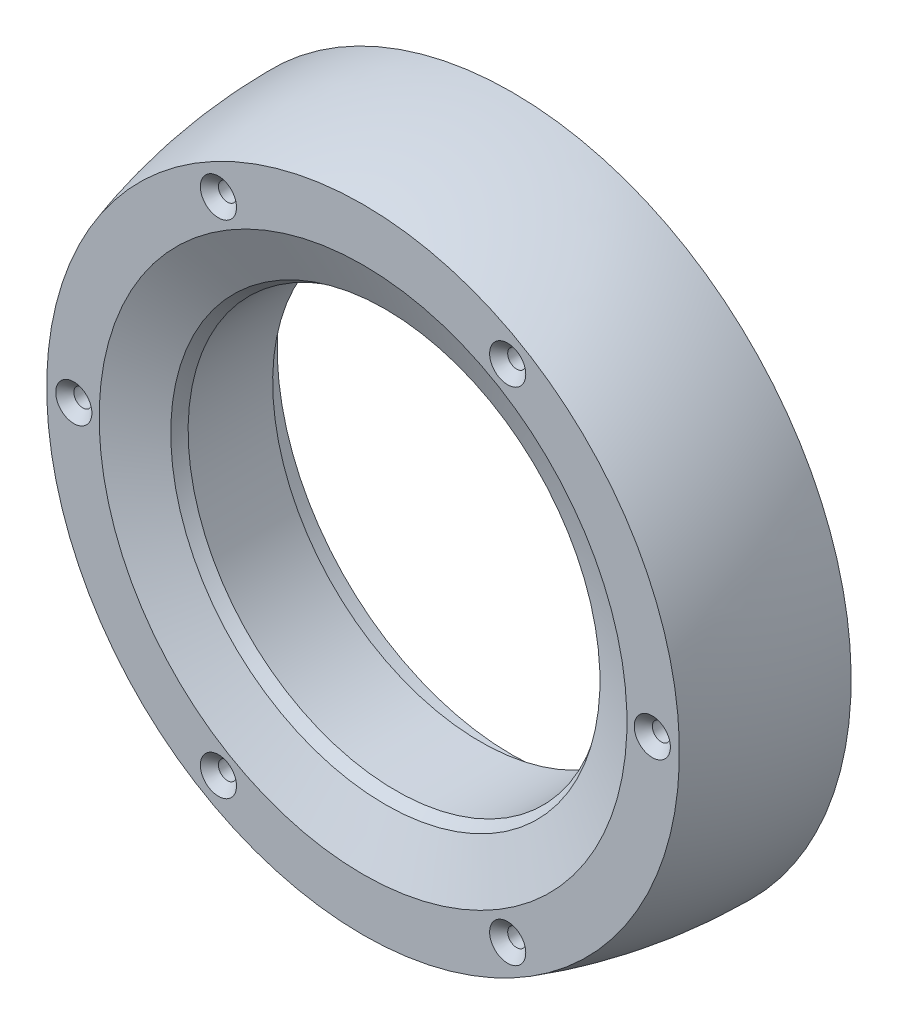
ISO-10303-21;
HEADER;
FILE_DESCRIPTION(('STEP AP214'),'2;1');
FILE_NAME('part.step','',(''),(''),'','','');
FILE_SCHEMA(('AUTOMOTIVE_DESIGN { 1 0 10303 214 1 1 1 1 }'));
ENDSEC;
DATA;
#1=APPLICATION_CONTEXT('core data for automotive mechanical design processes');
#2=APPLICATION_PROTOCOL_DEFINITION('international standard','automotive_design',2000,#1);
#3=PRODUCT_CONTEXT('',#1,'mechanical');
#4=PRODUCT('Part','Part','',(#3));
#5=PRODUCT_RELATED_PRODUCT_CATEGORY('part','',(#4));
#6=PRODUCT_DEFINITION_FORMATION('','',#4);
#7=PRODUCT_DEFINITION_CONTEXT('part definition',#1,'design');
#8=PRODUCT_DEFINITION('design','',#6,#7);
#9=PRODUCT_DEFINITION_SHAPE('','',#8);
#10=(LENGTH_UNIT() NAMED_UNIT(*) SI_UNIT(.MILLI.,.METRE.));
#11=(NAMED_UNIT(*) PLANE_ANGLE_UNIT() SI_UNIT($,.RADIAN.));
#12=(NAMED_UNIT(*) SI_UNIT($,.STERADIAN.) SOLID_ANGLE_UNIT());
#13=UNCERTAINTY_MEASURE_WITH_UNIT(LENGTH_MEASURE(1.E-05),#10,'distance_accuracy_value','');
#14=(GEOMETRIC_REPRESENTATION_CONTEXT(3) GLOBAL_UNCERTAINTY_ASSIGNED_CONTEXT((#13)) GLOBAL_UNIT_ASSIGNED_CONTEXT((#10,
#11,#12)) REPRESENTATION_CONTEXT('',''));
#15=CARTESIAN_POINT('',(0.,0.,0.));
#16=DIRECTION('',(0.,0.,1.));
#17=DIRECTION('',(1.,0.,0.));
#18=AXIS2_PLACEMENT_3D('',#15,#16,#17);
#19=CARTESIAN_POINT('',(0.,0.,16.5));
#20=DIRECTION('',(0.,0.,1.));
#21=DIRECTION('',(0.,-1.,0.));
#22=AXIS2_PLACEMENT_3D('',#19,#20,#21);
#23=PLANE('',#22);
#24=CARTESIAN_POINT('',(-16.,27.712812921102,16.5));
#25=DIRECTION('',(0.,0.,1.));
#26=DIRECTION('',(1.,0.,0.));
#27=AXIS2_PLACEMENT_3D('',#24,#25,#26);
#28=CIRCLE('',#27,2.);
#29=CARTESIAN_POINT('',(-14.,27.712812921102,16.5));
#30=VERTEX_POINT('',#29);
#31=EDGE_CURVE('E117',#30,#30,#28,.T.);
#32=ORIENTED_EDGE('',*,*,#31,.F.);
#33=EDGE_LOOP('',(#32));
#34=FACE_BOUND('',#33,.T.);
#35=CARTESIAN_POINT('',(16.,27.7128129211021,16.5));
#36=DIRECTION('',(0.,0.,1.));
#37=DIRECTION('',(1.,0.,0.));
#38=AXIS2_PLACEMENT_3D('',#35,#36,#37);
#39=CIRCLE('',#38,2.);
#40=CARTESIAN_POINT('',(18.,27.7128129211021,16.5));
#41=VERTEX_POINT('',#40);
#42=EDGE_CURVE('E108',#41,#41,#39,.T.);
#43=ORIENTED_EDGE('',*,*,#42,.F.);
#44=EDGE_LOOP('',(#43));
#45=FACE_BOUND('',#44,.T.);
#46=CARTESIAN_POINT('',(32.,0.,16.5));
#47=DIRECTION('',(0.,0.,1.));
#48=DIRECTION('',(1.,0.,0.));
#49=AXIS2_PLACEMENT_3D('',#46,#47,#48);
#50=CIRCLE('',#49,2.);
#51=CARTESIAN_POINT('',(34.,0.,16.5));
#52=VERTEX_POINT('',#51);
#53=EDGE_CURVE('E99',#52,#52,#50,.T.);
#54=ORIENTED_EDGE('',*,*,#53,.F.);
#55=EDGE_LOOP('',(#54));
#56=FACE_BOUND('',#55,.T.);
#57=CARTESIAN_POINT('',(16.,-27.7128129211021,16.5));
#58=DIRECTION('',(0.,0.,1.));
#59=DIRECTION('',(1.,0.,0.));
#60=AXIS2_PLACEMENT_3D('',#57,#58,#59);
#61=CIRCLE('',#60,2.);
#62=CARTESIAN_POINT('',(18.,-27.7128129211021,16.5));
#63=VERTEX_POINT('',#62);
#64=EDGE_CURVE('E90',#63,#63,#61,.T.);
#65=ORIENTED_EDGE('',*,*,#64,.F.);
#66=EDGE_LOOP('',(#65));
#67=FACE_BOUND('',#66,.T.);
#68=CARTESIAN_POINT('',(-16.,-27.7128129211021,16.5));
#69=DIRECTION('',(0.,0.,1.));
#70=DIRECTION('',(1.,0.,0.));
#71=AXIS2_PLACEMENT_3D('',#68,#69,#70);
#72=CIRCLE('',#71,2.);
#73=CARTESIAN_POINT('',(-14.,-27.7128129211021,16.5));
#74=VERTEX_POINT('',#73);
#75=EDGE_CURVE('E81',#74,#74,#72,.T.);
#76=ORIENTED_EDGE('',*,*,#75,.F.);
#77=EDGE_LOOP('',(#76));
#78=FACE_BOUND('',#77,.T.);
#79=CARTESIAN_POINT('',(-32.,0.,16.5));
#80=DIRECTION('',(0.,0.,1.));
#81=DIRECTION('',(1.,0.,0.));
#82=AXIS2_PLACEMENT_3D('',#79,#80,#81);
#83=CIRCLE('',#82,2.);
#84=CARTESIAN_POINT('',(-30.,0.,16.5));
#85=VERTEX_POINT('',#84);
#86=EDGE_CURVE('E72',#85,#85,#83,.T.);
#87=ORIENTED_EDGE('',*,*,#86,.F.);
#88=EDGE_LOOP('',(#87));
#89=FACE_BOUND('',#88,.T.);
#90=CARTESIAN_POINT('',(0.,0.,16.5));
#91=DIRECTION('',(0.,0.,1.));
#92=DIRECTION('',(0.,-1.,0.));
#93=AXIS2_PLACEMENT_3D('',#90,#91,#92);
#94=CIRCLE('',#93,29.196314195817);
#95=CARTESIAN_POINT('',(0.,-29.196314195817,16.5));
#96=VERTEX_POINT('',#95);
#97=EDGE_CURVE('E41',#96,#96,#94,.F.);
#98=ORIENTED_EDGE('',*,*,#97,.T.);
#99=EDGE_LOOP('',(#98));
#100=FACE_BOUND('',#99,.T.);
#101=CARTESIAN_POINT('',(0.,0.,16.5));
#102=DIRECTION('',(0.,0.,-1.));
#103=DIRECTION('',(0.,1.,0.));
#104=AXIS2_PLACEMENT_3D('',#101,#102,#103);
#105=CIRCLE('',#104,35.);
#106=CARTESIAN_POINT('',(0.,35.,16.5));
#107=VERTEX_POINT('',#106);
#108=EDGE_CURVE('E63',#107,#107,#105,.T.);
#109=ORIENTED_EDGE('',*,*,#108,.F.);
#110=EDGE_LOOP('',(#109));
#111=FACE_BOUND('',#110,.T.);
#112=ADVANCED_FACE('F34',(#34,#45,#56,#67,#78,#89,#100,#111),#23,.T.);
#113=CARTESIAN_POINT('',(0.,0.,22.5));
#114=DIRECTION('',(0.,0.,-1.));
#115=DIRECTION('',(0.,1.,0.));
#116=AXIS2_PLACEMENT_3D('',#113,#114,#115);
#117=DEGENERATE_TOROIDAL_SURFACE('',#116,9.,17.,.T.);
#118=CARTESIAN_POINT('',(0.,0.,14.0333791781715));
#119=DIRECTION('',(0.,0.,1.));
#120=DIRECTION('',(0.,-1.,0.));
#121=AXIS2_PLACEMENT_3D('',#118,#119,#120);
#122=CIRCLE('',#121,23.7416529554653);
#123=CARTESIAN_POINT('',(0.,-23.7416529554653,14.0333791781715));
#124=VERTEX_POINT('',#123);
#125=EDGE_CURVE('E10',#124,#124,#122,.T.);
#126=ORIENTED_EDGE('',*,*,#125,.T.);
#127=EDGE_LOOP('',(#126));
#128=FACE_BOUND('',#127,.T.);
#129=CARTESIAN_POINT('',(0.,0.,12.856349239007));
#130=DIRECTION('',(0.,0.,-1.));
#131=DIRECTION('',(0.,1.,0.));
#132=AXIS2_PLACEMENT_3D('',#129,#130,#131);
#133=CIRCLE('',#132,23.);
#134=CARTESIAN_POINT('',(0.,23.,12.856349239007));
#135=VERTEX_POINT('',#134);
#136=EDGE_CURVE('E45',#135,#135,#133,.T.);
#137=ORIENTED_EDGE('',*,*,#136,.T.);
#138=EDGE_LOOP('',(#137));
#139=FACE_BOUND('',#138,.T.);
#140=ADVANCED_FACE('F125',(#128,#139),#117,.F.);
#141=CARTESIAN_POINT('',(0.,0.,-11.0117281202219));
#142=DIRECTION('',(0.,0.,-1.));
#143=DIRECTION('',(0.,1.,0.));
#144=AXIS2_PLACEMENT_3D('',#141,#142,#143);
#145=CYLINDRICAL_SURFACE('',#144,23.);
#146=ORIENTED_EDGE('',*,*,#136,.F.);
#147=EDGE_LOOP('',(#146));
#148=FACE_BOUND('',#147,.T.);
#149=CARTESIAN_POINT('',(0.,0.,3.5));
#150=DIRECTION('',(0.,0.,-1.));
#151=DIRECTION('',(0.,1.,0.));
#152=AXIS2_PLACEMENT_3D('',#149,#150,#151);
#153=CIRCLE('',#152,23.);
#154=CARTESIAN_POINT('',(0.,23.,3.5));
#155=VERTEX_POINT('',#154);
#156=EDGE_CURVE('E49',#155,#155,#153,.T.);
#157=ORIENTED_EDGE('',*,*,#156,.T.);
#158=EDGE_LOOP('',(#157));
#159=FACE_BOUND('',#158,.T.);
#160=ADVANCED_FACE('F159',(#148,#159),#145,.F.);
#161=CARTESIAN_POINT('',(0.,0.,3.5));
#162=DIRECTION('',(0.,0.,1.));
#163=DIRECTION('',(0.,-1.,0.));
#164=AXIS2_PLACEMENT_3D('',#161,#162,#163);
#165=PLANE('',#164);
#166=ORIENTED_EDGE('',*,*,#156,.F.);
#167=EDGE_LOOP('',(#166));
#168=FACE_BOUND('',#167,.T.);
#169=CARTESIAN_POINT('',(0.,0.,3.5));
#170=DIRECTION('',(0.,0.,-1.));
#171=DIRECTION('',(0.,1.,0.));
#172=AXIS2_PLACEMENT_3D('',#169,#170,#171);
#173=CIRCLE('',#172,26.);
#174=CARTESIAN_POINT('',(0.,26.,3.5));
#175=VERTEX_POINT('',#174);
#176=EDGE_CURVE('E54',#175,#175,#173,.T.);
#177=ORIENTED_EDGE('',*,*,#176,.T.);
#178=EDGE_LOOP('',(#177));
#179=FACE_BOUND('',#178,.T.);
#180=ADVANCED_FACE('F154',(#168,#179),#165,.F.);
#181=CARTESIAN_POINT('',(0.,0.,-11.0117281202219));
#182=DIRECTION('',(0.,0.,-1.));
#183=DIRECTION('',(0.,1.,0.));
#184=AXIS2_PLACEMENT_3D('',#181,#182,#183);
#185=CYLINDRICAL_SURFACE('',#184,26.);
#186=CARTESIAN_POINT('',(0.,0.,0.));
#187=DIRECTION('',(0.,0.,-1.));
#188=DIRECTION('',(0.,1.,0.));
#189=AXIS2_PLACEMENT_3D('',#186,#187,#188);
#190=CIRCLE('',#189,26.);
#191=CARTESIAN_POINT('',(0.,26.,0.));
#192=VERTEX_POINT('',#191);
#193=EDGE_CURVE('E57',#192,#192,#190,.T.);
#194=ORIENTED_EDGE('',*,*,#193,.T.);
#195=EDGE_LOOP('',(#194));
#196=FACE_BOUND('',#195,.T.);
#197=ORIENTED_EDGE('',*,*,#176,.F.);
#198=EDGE_LOOP('',(#197));
#199=FACE_BOUND('',#198,.T.);
#200=ADVANCED_FACE('F147',(#196,#199),#185,.F.);
#201=CARTESIAN_POINT('',(0.,0.,0.));
#202=DIRECTION('',(0.,0.,-1.));
#203=DIRECTION('',(0.,1.,0.));
#204=AXIS2_PLACEMENT_3D('',#201,#202,#203);
#205=PLANE('',#204);
#206=CARTESIAN_POINT('',(-16.,27.712812921102,0.));
#207=DIRECTION('',(0.,0.,1.));
#208=DIRECTION('',(1.,0.,0.));
#209=AXIS2_PLACEMENT_3D('',#206,#207,#208);
#210=CIRCLE('',#209,0.999999999999996);
#211=CARTESIAN_POINT('',(-15.,27.712812921102,0.));
#212=VERTEX_POINT('',#211);
#213=EDGE_CURVE('E111',#212,#212,#210,.T.);
#214=ORIENTED_EDGE('',*,*,#213,.T.);
#215=EDGE_LOOP('',(#214));
#216=FACE_BOUND('',#215,.T.);
#217=CARTESIAN_POINT('',(16.,27.7128129211021,0.));
#218=DIRECTION('',(0.,0.,1.));
#219=DIRECTION('',(1.,0.,0.));
#220=AXIS2_PLACEMENT_3D('',#217,#218,#219);
#221=CIRCLE('',#220,0.999999999999997);
#222=CARTESIAN_POINT('',(17.,27.7128129211021,0.));
#223=VERTEX_POINT('',#222);
#224=EDGE_CURVE('E102',#223,#223,#221,.T.);
#225=ORIENTED_EDGE('',*,*,#224,.T.);
#226=EDGE_LOOP('',(#225));
#227=FACE_BOUND('',#226,.T.);
#228=CARTESIAN_POINT('',(32.,0.,0.));
#229=DIRECTION('',(0.,0.,1.));
#230=DIRECTION('',(1.,0.,0.));
#231=AXIS2_PLACEMENT_3D('',#228,#229,#230);
#232=CIRCLE('',#231,0.999999999999994);
#233=CARTESIAN_POINT('',(33.,0.,0.));
#234=VERTEX_POINT('',#233);
#235=EDGE_CURVE('E93',#234,#234,#232,.T.);
#236=ORIENTED_EDGE('',*,*,#235,.T.);
#237=EDGE_LOOP('',(#236));
#238=FACE_BOUND('',#237,.T.);
#239=CARTESIAN_POINT('',(16.,-27.7128129211021,0.));
#240=DIRECTION('',(0.,0.,1.));
#241=DIRECTION('',(1.,0.,0.));
#242=AXIS2_PLACEMENT_3D('',#239,#240,#241);
#243=CIRCLE('',#242,0.999999999999997);
#244=CARTESIAN_POINT('',(17.,-27.7128129211021,0.));
#245=VERTEX_POINT('',#244);
#246=EDGE_CURVE('E84',#245,#245,#243,.T.);
#247=ORIENTED_EDGE('',*,*,#246,.T.);
#248=EDGE_LOOP('',(#247));
#249=FACE_BOUND('',#248,.T.);
#250=CARTESIAN_POINT('',(-16.,-27.7128129211021,0.));
#251=DIRECTION('',(0.,0.,1.));
#252=DIRECTION('',(1.,0.,0.));
#253=AXIS2_PLACEMENT_3D('',#250,#251,#252);
#254=CIRCLE('',#253,0.999999999999996);
#255=CARTESIAN_POINT('',(-15.,-27.7128129211021,0.));
#256=VERTEX_POINT('',#255);
#257=EDGE_CURVE('E75',#256,#256,#254,.T.);
#258=ORIENTED_EDGE('',*,*,#257,.T.);
#259=EDGE_LOOP('',(#258));
#260=FACE_BOUND('',#259,.T.);
#261=CARTESIAN_POINT('',(-32.,0.,0.));
#262=DIRECTION('',(0.,0.,1.));
#263=DIRECTION('',(1.,0.,0.));
#264=AXIS2_PLACEMENT_3D('',#261,#262,#263);
#265=CIRCLE('',#264,0.999999999999997);
#266=CARTESIAN_POINT('',(-31.,0.,0.));
#267=VERTEX_POINT('',#266);
#268=EDGE_CURVE('E66',#267,#267,#265,.T.);
#269=ORIENTED_EDGE('',*,*,#268,.T.);
#270=EDGE_LOOP('',(#269));
#271=FACE_BOUND('',#270,.T.);
#272=CARTESIAN_POINT('',(0.,0.,0.));
#273=DIRECTION('',(0.,0.,-1.));
#274=DIRECTION('',(0.,1.,0.));
#275=AXIS2_PLACEMENT_3D('',#272,#273,#274);
#276=CIRCLE('',#275,37.5);
#277=CARTESIAN_POINT('',(0.,37.5,0.));
#278=VERTEX_POINT('',#277);
#279=EDGE_CURVE('E60',#278,#278,#276,.T.);
#280=ORIENTED_EDGE('',*,*,#279,.T.);
#281=EDGE_LOOP('',(#280));
#282=FACE_BOUND('',#281,.T.);
#283=ORIENTED_EDGE('',*,*,#193,.F.);
#284=EDGE_LOOP('',(#283));
#285=FACE_BOUND('',#284,.T.);
#286=ADVANCED_FACE('F141',(#216,#227,#238,#249,#260,#271,#282,#285),#205,.T.);
#287=CARTESIAN_POINT('',(0.,0.,0.));
#288=DIRECTION('',(0.,0.,-1.));
#289=DIRECTION('',(0.,1.,0.));
#290=AXIS2_PLACEMENT_3D('',#287,#288,#289);
#291=DEGENERATE_TOROIDAL_SURFACE('',#290,18.2000000000001,55.7000000000001,.F.);
#292=ORIENTED_EDGE('',*,*,#108,.T.);
#293=EDGE_LOOP('',(#292));
#294=FACE_BOUND('',#293,.T.);
#295=ORIENTED_EDGE('',*,*,#279,.F.);
#296=EDGE_LOOP('',(#295));
#297=FACE_BOUND('',#296,.T.);
#298=ADVANCED_FACE('F138',(#294,#297),#291,.F.);
#299=CARTESIAN_POINT('',(0.,0.,16.5));
#300=DIRECTION('',(0.,0.,1.));
#301=DIRECTION('',(0.,-1.,0.));
#302=AXIS2_PLACEMENT_3D('',#299,#300,#301);
#303=CONICAL_SURFACE('',#302,29.196314195817,1.14611088376097);
#304=ORIENTED_EDGE('',*,*,#125,.F.);
#305=EDGE_LOOP('',(#304));
#306=FACE_BOUND('',#305,.T.);
#307=ORIENTED_EDGE('',*,*,#97,.F.);
#308=EDGE_LOOP('',(#307));
#309=FACE_BOUND('',#308,.T.);
#310=ADVANCED_FACE('F36',(#306,#309),#303,.F.);
#311=CARTESIAN_POINT('',(-32.,0.,16.5));
#312=DIRECTION('',(0.,0.,1.));
#313=DIRECTION('',(1.,0.,0.));
#314=AXIS2_PLACEMENT_3D('',#311,#312,#313);
#315=CYLINDRICAL_SURFACE('',#314,0.999999999999997);
#316=ORIENTED_EDGE('',*,*,#268,.F.);
#317=EDGE_LOOP('',(#316));
#318=FACE_BOUND('',#317,.T.);
#319=CARTESIAN_POINT('',(-32.,0.,15.5));
#320=DIRECTION('',(0.,0.,1.));
#321=DIRECTION('',(1.,0.,0.));
#322=AXIS2_PLACEMENT_3D('',#319,#320,#321);
#323=CIRCLE('',#322,0.999999999999997);
#324=CARTESIAN_POINT('',(-31.,0.,15.5));
#325=VERTEX_POINT('',#324);
#326=EDGE_CURVE('E69',#325,#325,#323,.T.);
#327=ORIENTED_EDGE('',*,*,#326,.T.);
#328=EDGE_LOOP('',(#327));
#329=FACE_BOUND('',#328,.T.);
#330=ADVANCED_FACE('F209',(#318,#329),#315,.F.);
#331=CARTESIAN_POINT('',(-32.,0.,16.5));
#332=DIRECTION('',(0.,0.,1.));
#333=DIRECTION('',(1.,0.,0.));
#334=AXIS2_PLACEMENT_3D('',#331,#332,#333);
#335=CONICAL_SURFACE('',#334,2.,0.785398163397448);
#336=ORIENTED_EDGE('',*,*,#326,.F.);
#337=EDGE_LOOP('',(#336));
#338=FACE_BOUND('',#337,.T.);
#339=ORIENTED_EDGE('',*,*,#86,.T.);
#340=EDGE_LOOP('',(#339));
#341=FACE_BOUND('',#340,.T.);
#342=ADVANCED_FACE('F215',(#338,#341),#335,.F.);
#343=CARTESIAN_POINT('',(-16.,-27.7128129211021,16.5));
#344=DIRECTION('',(0.,0.,1.));
#345=DIRECTION('',(1.,0.,0.));
#346=AXIS2_PLACEMENT_3D('',#343,#344,#345);
#347=CYLINDRICAL_SURFACE('',#346,0.999999999999997);
#348=ORIENTED_EDGE('',*,*,#257,.F.);
#349=EDGE_LOOP('',(#348));
#350=FACE_BOUND('',#349,.T.);
#351=CARTESIAN_POINT('',(-16.,-27.7128129211021,15.5));
#352=DIRECTION('',(0.,0.,1.));
#353=DIRECTION('',(1.,0.,0.));
#354=AXIS2_PLACEMENT_3D('',#351,#352,#353);
#355=CIRCLE('',#354,0.999999999999997);
#356=CARTESIAN_POINT('',(-15.,-27.7128129211021,15.5));
#357=VERTEX_POINT('',#356);
#358=EDGE_CURVE('E78',#357,#357,#355,.T.);
#359=ORIENTED_EDGE('',*,*,#358,.T.);
#360=EDGE_LOOP('',(#359));
#361=FACE_BOUND('',#360,.T.);
#362=ADVANCED_FACE('F224',(#350,#361),#347,.F.);
#363=CARTESIAN_POINT('',(-16.,-27.7128129211021,16.5));
#364=DIRECTION('',(0.,0.,1.));
#365=DIRECTION('',(1.,0.,0.));
#366=AXIS2_PLACEMENT_3D('',#363,#364,#365);
#367=CONICAL_SURFACE('',#366,2.,0.785398163397447);
#368=ORIENTED_EDGE('',*,*,#358,.F.);
#369=EDGE_LOOP('',(#368));
#370=FACE_BOUND('',#369,.T.);
#371=ORIENTED_EDGE('',*,*,#75,.T.);
#372=EDGE_LOOP('',(#371));
#373=FACE_BOUND('',#372,.T.);
#374=ADVANCED_FACE('F232',(#370,#373),#367,.F.);
#375=CARTESIAN_POINT('',(16.,-27.7128129211021,16.5));
#376=DIRECTION('',(0.,0.,1.));
#377=DIRECTION('',(1.,0.,0.));
#378=AXIS2_PLACEMENT_3D('',#375,#376,#377);
#379=CYLINDRICAL_SURFACE('',#378,0.999999999999997);
#380=ORIENTED_EDGE('',*,*,#246,.F.);
#381=EDGE_LOOP('',(#380));
#382=FACE_BOUND('',#381,.T.);
#383=CARTESIAN_POINT('',(16.,-27.7128129211021,15.5));
#384=DIRECTION('',(0.,0.,1.));
#385=DIRECTION('',(1.,0.,0.));
#386=AXIS2_PLACEMENT_3D('',#383,#384,#385);
#387=CIRCLE('',#386,0.999999999999997);
#388=CARTESIAN_POINT('',(17.,-27.7128129211021,15.5));
#389=VERTEX_POINT('',#388);
#390=EDGE_CURVE('E87',#389,#389,#387,.T.);
#391=ORIENTED_EDGE('',*,*,#390,.T.);
#392=EDGE_LOOP('',(#391));
#393=FACE_BOUND('',#392,.T.);
#394=ADVANCED_FACE('F240',(#382,#393),#379,.F.);
#395=CARTESIAN_POINT('',(16.,-27.7128129211021,16.5));
#396=DIRECTION('',(0.,0.,1.));
#397=DIRECTION('',(1.,0.,0.));
#398=AXIS2_PLACEMENT_3D('',#395,#396,#397);
#399=CONICAL_SURFACE('',#398,2.,0.785398163397447);
#400=ORIENTED_EDGE('',*,*,#390,.F.);
#401=EDGE_LOOP('',(#400));
#402=FACE_BOUND('',#401,.T.);
#403=ORIENTED_EDGE('',*,*,#64,.T.);
#404=EDGE_LOOP('',(#403));
#405=FACE_BOUND('',#404,.T.);
#406=ADVANCED_FACE('F248',(#402,#405),#399,.F.);
#407=CARTESIAN_POINT('',(32.,0.,16.5));
#408=DIRECTION('',(0.,0.,1.));
#409=DIRECTION('',(1.,0.,0.));
#410=AXIS2_PLACEMENT_3D('',#407,#408,#409);
#411=CYLINDRICAL_SURFACE('',#410,0.999999999999997);
#412=ORIENTED_EDGE('',*,*,#235,.F.);
#413=EDGE_LOOP('',(#412));
#414=FACE_BOUND('',#413,.T.);
#415=CARTESIAN_POINT('',(32.,0.,15.5));
#416=DIRECTION('',(0.,0.,1.));
#417=DIRECTION('',(1.,0.,0.));
#418=AXIS2_PLACEMENT_3D('',#415,#416,#417);
#419=CIRCLE('',#418,1.);
#420=CARTESIAN_POINT('',(33.,0.,15.5));
#421=VERTEX_POINT('',#420);
#422=EDGE_CURVE('E96',#421,#421,#419,.T.);
#423=ORIENTED_EDGE('',*,*,#422,.T.);
#424=EDGE_LOOP('',(#423));
#425=FACE_BOUND('',#424,.T.);
#426=ADVANCED_FACE('F256',(#414,#425),#411,.F.);
#427=CARTESIAN_POINT('',(32.,0.,16.5));
#428=DIRECTION('',(0.,0.,1.));
#429=DIRECTION('',(1.,0.,0.));
#430=AXIS2_PLACEMENT_3D('',#427,#428,#429);
#431=CONICAL_SURFACE('',#430,2.,0.785398163397447);
#432=ORIENTED_EDGE('',*,*,#422,.F.);
#433=EDGE_LOOP('',(#432));
#434=FACE_BOUND('',#433,.T.);
#435=ORIENTED_EDGE('',*,*,#53,.T.);
#436=EDGE_LOOP('',(#435));
#437=FACE_BOUND('',#436,.T.);
#438=ADVANCED_FACE('F264',(#434,#437),#431,.F.);
#439=CARTESIAN_POINT('',(16.,27.7128129211021,16.5));
#440=DIRECTION('',(0.,0.,1.));
#441=DIRECTION('',(1.,0.,0.));
#442=AXIS2_PLACEMENT_3D('',#439,#440,#441);
#443=CYLINDRICAL_SURFACE('',#442,0.999999999999997);
#444=ORIENTED_EDGE('',*,*,#224,.F.);
#445=EDGE_LOOP('',(#444));
#446=FACE_BOUND('',#445,.T.);
#447=CARTESIAN_POINT('',(16.,27.7128129211021,15.5));
#448=DIRECTION('',(0.,0.,1.));
#449=DIRECTION('',(1.,0.,0.));
#450=AXIS2_PLACEMENT_3D('',#447,#448,#449);
#451=CIRCLE('',#450,0.999999999999997);
#452=CARTESIAN_POINT('',(17.,27.7128129211021,15.5));
#453=VERTEX_POINT('',#452);
#454=EDGE_CURVE('E105',#453,#453,#451,.T.);
#455=ORIENTED_EDGE('',*,*,#454,.T.);
#456=EDGE_LOOP('',(#455));
#457=FACE_BOUND('',#456,.T.);
#458=ADVANCED_FACE('F272',(#446,#457),#443,.F.);
#459=CARTESIAN_POINT('',(16.,27.7128129211021,16.5));
#460=DIRECTION('',(0.,0.,1.));
#461=DIRECTION('',(1.,0.,0.));
#462=AXIS2_PLACEMENT_3D('',#459,#460,#461);
#463=CONICAL_SURFACE('',#462,2.,0.785398163397447);
#464=ORIENTED_EDGE('',*,*,#454,.F.);
#465=EDGE_LOOP('',(#464));
#466=FACE_BOUND('',#465,.T.);
#467=ORIENTED_EDGE('',*,*,#42,.T.);
#468=EDGE_LOOP('',(#467));
#469=FACE_BOUND('',#468,.T.);
#470=ADVANCED_FACE('F280',(#466,#469),#463,.F.);
#471=CARTESIAN_POINT('',(-16.,27.712812921102,16.5));
#472=DIRECTION('',(0.,0.,1.));
#473=DIRECTION('',(1.,0.,0.));
#474=AXIS2_PLACEMENT_3D('',#471,#472,#473);
#475=CYLINDRICAL_SURFACE('',#474,0.999999999999997);
#476=ORIENTED_EDGE('',*,*,#213,.F.);
#477=EDGE_LOOP('',(#476));
#478=FACE_BOUND('',#477,.T.);
#479=CARTESIAN_POINT('',(-16.,27.712812921102,15.5));
#480=DIRECTION('',(0.,0.,1.));
#481=DIRECTION('',(1.,0.,0.));
#482=AXIS2_PLACEMENT_3D('',#479,#480,#481);
#483=CIRCLE('',#482,0.999999999999997);
#484=CARTESIAN_POINT('',(-15.,27.712812921102,15.5));
#485=VERTEX_POINT('',#484);
#486=EDGE_CURVE('E114',#485,#485,#483,.T.);
#487=ORIENTED_EDGE('',*,*,#486,.T.);
#488=EDGE_LOOP('',(#487));
#489=FACE_BOUND('',#488,.T.);
#490=ADVANCED_FACE('F288',(#478,#489),#475,.F.);
#491=CARTESIAN_POINT('',(-16.,27.712812921102,16.5));
#492=DIRECTION('',(0.,0.,1.));
#493=DIRECTION('',(1.,0.,0.));
#494=AXIS2_PLACEMENT_3D('',#491,#492,#493);
#495=CONICAL_SURFACE('',#494,2.,0.785398163397447);
#496=ORIENTED_EDGE('',*,*,#486,.F.);
#497=EDGE_LOOP('',(#496));
#498=FACE_BOUND('',#497,.T.);
#499=ORIENTED_EDGE('',*,*,#31,.T.);
#500=EDGE_LOOP('',(#499));
#501=FACE_BOUND('',#500,.T.);
#502=ADVANCED_FACE('F121',(#498,#501),#495,.F.);
#503=CLOSED_SHELL('',(#112,#140,#160,#180,#200,#286,#298,#310,#330,#342,#362,#374,#394,#406,
#426,#438,#458,#470,#490,#502));
#504=MANIFOLD_SOLID_BREP('B2',#503);
#505=ADVANCED_BREP_SHAPE_REPRESENTATION('',(#18,#504),#14);
#506=SHAPE_DEFINITION_REPRESENTATION(#9,#505);
ENDSEC;
END-ISO-10303-21;
